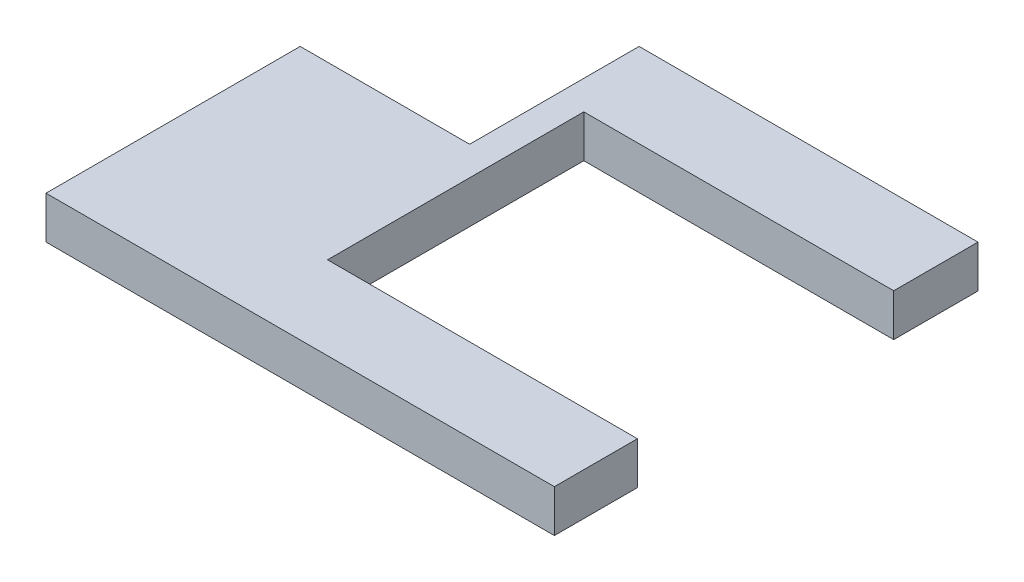
ISO-10303-21;
HEADER;
FILE_DESCRIPTION(('STEP AP214'),'2;1');
FILE_NAME('part.step','',(''),(''),'','','');
FILE_SCHEMA(('AUTOMOTIVE_DESIGN { 1 0 10303 214 1 1 1 1 }'));
ENDSEC;
DATA;
#1=APPLICATION_CONTEXT('core data for automotive mechanical design processes');
#2=APPLICATION_PROTOCOL_DEFINITION('international standard','automotive_design',2000,#1);
#3=PRODUCT_CONTEXT('',#1,'mechanical');
#4=PRODUCT('Part','Part','',(#3));
#5=PRODUCT_RELATED_PRODUCT_CATEGORY('part','',(#4));
#6=PRODUCT_DEFINITION_FORMATION('','',#4);
#7=PRODUCT_DEFINITION_CONTEXT('part definition',#1,'design');
#8=PRODUCT_DEFINITION('design','',#6,#7);
#9=PRODUCT_DEFINITION_SHAPE('','',#8);
#10=(LENGTH_UNIT() NAMED_UNIT(*) SI_UNIT(.MILLI.,.METRE.));
#11=(NAMED_UNIT(*) PLANE_ANGLE_UNIT() SI_UNIT($,.RADIAN.));
#12=(NAMED_UNIT(*) SI_UNIT($,.STERADIAN.) SOLID_ANGLE_UNIT());
#13=UNCERTAINTY_MEASURE_WITH_UNIT(LENGTH_MEASURE(1.E-05),#10,'distance_accuracy_value','');
#14=(GEOMETRIC_REPRESENTATION_CONTEXT(3) GLOBAL_UNCERTAINTY_ASSIGNED_CONTEXT((#13)) GLOBAL_UNIT_ASSIGNED_CONTEXT((#10,
#11,#12)) REPRESENTATION_CONTEXT('',''));
#15=CARTESIAN_POINT('',(0.,0.,0.));
#16=DIRECTION('',(0.,0.,1.));
#17=DIRECTION('',(1.,0.,0.));
#18=AXIS2_PLACEMENT_3D('',#15,#16,#17);
#19=CARTESIAN_POINT('',(0.,10.,-60.));
#20=DIRECTION('',(1.,0.,0.));
#21=DIRECTION('',(0.,0.,-1.));
#22=AXIS2_PLACEMENT_3D('',#19,#20,#21);
#23=PLANE('',#22);
#24=DIRECTION('',(0.,0.,1.));
#25=VECTOR('',#24,1.);
#26=CARTESIAN_POINT('',(0.,0.,-60.));
#27=LINE('',#26,#25);
#28=CARTESIAN_POINT('',(0.,0.,-60.));
#29=VERTEX_POINT('',#28);
#30=CARTESIAN_POINT('',(0.,0.,0.));
#31=VERTEX_POINT('',#30);
#32=EDGE_CURVE('E143',#29,#31,#27,.T.);
#33=ORIENTED_EDGE('',*,*,#32,.T.);
#34=DIRECTION('',(0.,-1.,0.));
#35=VECTOR('',#34,1.);
#36=CARTESIAN_POINT('',(0.,10.,0.));
#37=LINE('',#36,#35);
#38=CARTESIAN_POINT('',(0.,10.,0.));
#39=VERTEX_POINT('',#38);
#40=EDGE_CURVE('E11',#39,#31,#37,.T.);
#41=ORIENTED_EDGE('',*,*,#40,.F.);
#42=DIRECTION('',(0.,0.,1.));
#43=VECTOR('',#42,1.);
#44=CARTESIAN_POINT('',(0.,10.,-60.));
#45=LINE('',#44,#43);
#46=CARTESIAN_POINT('',(0.,10.,-60.));
#47=VERTEX_POINT('',#46);
#48=EDGE_CURVE('E161',#47,#39,#45,.T.);
#49=ORIENTED_EDGE('',*,*,#48,.F.);
#50=DIRECTION('',(0.,-1.,0.));
#51=VECTOR('',#50,1.);
#52=CARTESIAN_POINT('',(0.,10.,-60.));
#53=LINE('',#52,#51);
#54=EDGE_CURVE('E139',#47,#29,#53,.T.);
#55=ORIENTED_EDGE('',*,*,#54,.T.);
#56=EDGE_LOOP('',(#33,#41,#49,#55));
#57=FACE_BOUND('',#56,.T.);
#58=ADVANCED_FACE('F35',(#57),#23,.F.);
#59=CARTESIAN_POINT('',(0.,10.,0.));
#60=DIRECTION('',(0.,0.,-1.));
#61=DIRECTION('',(-1.,0.,0.));
#62=AXIS2_PLACEMENT_3D('',#59,#60,#61);
#63=PLANE('',#62);
#64=DIRECTION('',(1.,0.,0.));
#65=VECTOR('',#64,1.);
#66=CARTESIAN_POINT('',(0.,0.,0.));
#67=LINE('',#66,#65);
#68=CARTESIAN_POINT('',(120.,0.,0.));
#69=VERTEX_POINT('',#68);
#70=EDGE_CURVE('E146',#31,#69,#67,.T.);
#71=ORIENTED_EDGE('',*,*,#70,.T.);
#72=DIRECTION('',(0.,-1.,0.));
#73=VECTOR('',#72,1.);
#74=CARTESIAN_POINT('',(120.,10.,0.));
#75=LINE('',#74,#73);
#76=CARTESIAN_POINT('',(120.,10.,0.));
#77=VERTEX_POINT('',#76);
#78=EDGE_CURVE('E43',#77,#69,#75,.T.);
#79=ORIENTED_EDGE('',*,*,#78,.F.);
#80=DIRECTION('',(1.,0.,0.));
#81=VECTOR('',#80,1.);
#82=CARTESIAN_POINT('',(0.,10.,0.));
#83=LINE('',#82,#81);
#84=EDGE_CURVE('E100',#39,#77,#83,.T.);
#85=ORIENTED_EDGE('',*,*,#84,.F.);
#86=ORIENTED_EDGE('',*,*,#40,.T.);
#87=EDGE_LOOP('',(#71,#79,#85,#86));
#88=FACE_BOUND('',#87,.T.);
#89=ADVANCED_FACE('F210',(#88),#63,.F.);
#90=CARTESIAN_POINT('',(120.,10.,0.));
#91=DIRECTION('',(-1.,0.,0.));
#92=DIRECTION('',(0.,0.,1.));
#93=AXIS2_PLACEMENT_3D('',#90,#91,#92);
#94=PLANE('',#93);
#95=DIRECTION('',(0.,0.,-1.));
#96=VECTOR('',#95,1.);
#97=CARTESIAN_POINT('',(120.,0.,0.));
#98=LINE('',#97,#96);
#99=CARTESIAN_POINT('',(120.,0.,-19.6053445452307));
#100=VERTEX_POINT('',#99);
#101=EDGE_CURVE('E148',#69,#100,#98,.T.);
#102=ORIENTED_EDGE('',*,*,#101,.T.);
#103=DIRECTION('',(0.,-1.,0.));
#104=VECTOR('',#103,1.);
#105=CARTESIAN_POINT('',(120.,10.,-19.6053445452307));
#106=LINE('',#105,#104);
#107=CARTESIAN_POINT('',(120.,10.,-19.6053445452307));
#108=VERTEX_POINT('',#107);
#109=EDGE_CURVE('E174',#108,#100,#106,.T.);
#110=ORIENTED_EDGE('',*,*,#109,.F.);
#111=DIRECTION('',(0.,0.,-1.));
#112=VECTOR('',#111,1.);
#113=CARTESIAN_POINT('',(120.,10.,0.));
#114=LINE('',#113,#112);
#115=EDGE_CURVE('E182',#77,#108,#114,.T.);
#116=ORIENTED_EDGE('',*,*,#115,.F.);
#117=ORIENTED_EDGE('',*,*,#78,.T.);
#118=EDGE_LOOP('',(#102,#110,#116,#117));
#119=FACE_BOUND('',#118,.T.);
#120=ADVANCED_FACE('F180',(#119),#94,.F.);
#121=CARTESIAN_POINT('',(120.,10.,-19.6053445452307));
#122=DIRECTION('',(0.,0.,1.));
#123=DIRECTION('',(1.,0.,0.));
#124=AXIS2_PLACEMENT_3D('',#121,#122,#123);
#125=PLANE('',#124);
#126=DIRECTION('',(-1.,0.,0.));
#127=VECTOR('',#126,1.);
#128=CARTESIAN_POINT('',(120.,0.,-19.6053445452307));
#129=LINE('',#128,#127);
#130=CARTESIAN_POINT('',(46.8508304600234,0.,-19.6053445452307));
#131=VERTEX_POINT('',#130);
#132=EDGE_CURVE('E150',#100,#131,#129,.T.);
#133=ORIENTED_EDGE('',*,*,#132,.T.);
#134=DIRECTION('',(0.,-1.,0.));
#135=VECTOR('',#134,1.);
#136=CARTESIAN_POINT('',(46.8508304600234,10.,-19.6053445452307));
#137=LINE('',#136,#135);
#138=CARTESIAN_POINT('',(46.8508304600234,10.,-19.6053445452307));
#139=VERTEX_POINT('',#138);
#140=EDGE_CURVE('E171',#139,#131,#137,.T.);
#141=ORIENTED_EDGE('',*,*,#140,.F.);
#142=DIRECTION('',(-1.,0.,0.));
#143=VECTOR('',#142,1.);
#144=CARTESIAN_POINT('',(120.,10.,-19.6053445452307));
#145=LINE('',#144,#143);
#146=EDGE_CURVE('E200',#108,#139,#145,.T.);
#147=ORIENTED_EDGE('',*,*,#146,.F.);
#148=ORIENTED_EDGE('',*,*,#109,.T.);
#149=EDGE_LOOP('',(#133,#141,#147,#148));
#150=FACE_BOUND('',#149,.T.);
#151=ADVANCED_FACE('F191',(#150),#125,.F.);
#152=CARTESIAN_POINT('',(46.8508304600234,10.,-19.6053445452307));
#153=DIRECTION('',(-1.,0.,0.));
#154=DIRECTION('',(0.,0.,1.));
#155=AXIS2_PLACEMENT_3D('',#152,#153,#154);
#156=PLANE('',#155);
#157=DIRECTION('',(0.,0.,-1.));
#158=VECTOR('',#157,1.);
#159=CARTESIAN_POINT('',(46.8508304600234,0.,-19.6053445452307));
#160=LINE('',#159,#158);
#161=CARTESIAN_POINT('',(46.8508304600234,0.,-80.1035520463399));
#162=VERTEX_POINT('',#161);
#163=EDGE_CURVE('E152',#131,#162,#160,.T.);
#164=ORIENTED_EDGE('',*,*,#163,.T.);
#165=DIRECTION('',(0.,-1.,0.));
#166=VECTOR('',#165,1.);
#167=CARTESIAN_POINT('',(46.8508304600234,10.,-80.1035520463399));
#168=LINE('',#167,#166);
#169=CARTESIAN_POINT('',(46.8508304600234,10.,-80.1035520463399));
#170=VERTEX_POINT('',#169);
#171=EDGE_CURVE('E168',#170,#162,#168,.T.);
#172=ORIENTED_EDGE('',*,*,#171,.F.);
#173=DIRECTION('',(0.,0.,-1.));
#174=VECTOR('',#173,1.);
#175=CARTESIAN_POINT('',(46.8508304600234,10.,-19.6053445452307));
#176=LINE('',#175,#174);
#177=EDGE_CURVE('E197',#139,#170,#176,.T.);
#178=ORIENTED_EDGE('',*,*,#177,.F.);
#179=ORIENTED_EDGE('',*,*,#140,.T.);
#180=EDGE_LOOP('',(#164,#172,#178,#179));
#181=FACE_BOUND('',#180,.T.);
#182=ADVANCED_FACE('F195',(#181),#156,.F.);
#183=CARTESIAN_POINT('',(46.8508304600234,10.,-80.1035520463399));
#184=DIRECTION('',(0.,0.,-1.));
#185=DIRECTION('',(-1.,0.,0.));
#186=AXIS2_PLACEMENT_3D('',#183,#184,#185);
#187=PLANE('',#186);
#188=DIRECTION('',(1.,0.,0.));
#189=VECTOR('',#188,1.);
#190=CARTESIAN_POINT('',(46.8508304600234,0.,-80.1035520463399));
#191=LINE('',#190,#189);
#192=CARTESIAN_POINT('',(120.,0.,-80.1035520463399));
#193=VERTEX_POINT('',#192);
#194=EDGE_CURVE('E154',#162,#193,#191,.T.);
#195=ORIENTED_EDGE('',*,*,#194,.T.);
#196=DIRECTION('',(0.,-1.,0.));
#197=VECTOR('',#196,1.);
#198=CARTESIAN_POINT('',(120.,10.,-80.1035520463399));
#199=LINE('',#198,#197);
#200=CARTESIAN_POINT('',(120.,10.,-80.1035520463399));
#201=VERTEX_POINT('',#200);
#202=EDGE_CURVE('E165',#201,#193,#199,.T.);
#203=ORIENTED_EDGE('',*,*,#202,.F.);
#204=DIRECTION('',(1.,0.,0.));
#205=VECTOR('',#204,1.);
#206=CARTESIAN_POINT('',(46.8508304600234,10.,-80.1035520463399));
#207=LINE('',#206,#205);
#208=EDGE_CURVE('E199',#170,#201,#207,.T.);
#209=ORIENTED_EDGE('',*,*,#208,.F.);
#210=ORIENTED_EDGE('',*,*,#171,.T.);
#211=EDGE_LOOP('',(#195,#203,#209,#210));
#212=FACE_BOUND('',#211,.T.);
#213=ADVANCED_FACE('F222',(#212),#187,.F.);
#214=CARTESIAN_POINT('',(120.,10.,-80.1035520463399));
#215=DIRECTION('',(-1.,0.,0.));
#216=DIRECTION('',(0.,0.,1.));
#217=AXIS2_PLACEMENT_3D('',#214,#215,#216);
#218=PLANE('',#217);
#219=DIRECTION('',(0.,0.,-1.));
#220=VECTOR('',#219,1.);
#221=CARTESIAN_POINT('',(120.,0.,-80.1035520463399));
#222=LINE('',#221,#220);
#223=CARTESIAN_POINT('',(120.,0.,-100.));
#224=VERTEX_POINT('',#223);
#225=EDGE_CURVE('E156',#193,#224,#222,.T.);
#226=ORIENTED_EDGE('',*,*,#225,.T.);
#227=DIRECTION('',(0.,-1.,0.));
#228=VECTOR('',#227,1.);
#229=CARTESIAN_POINT('',(120.,10.,-100.));
#230=LINE('',#229,#228);
#231=CARTESIAN_POINT('',(120.,10.,-100.));
#232=VERTEX_POINT('',#231);
#233=EDGE_CURVE('E134',#232,#224,#230,.T.);
#234=ORIENTED_EDGE('',*,*,#233,.F.);
#235=DIRECTION('',(0.,0.,-1.));
#236=VECTOR('',#235,1.);
#237=CARTESIAN_POINT('',(120.,10.,-80.1035520463399));
#238=LINE('',#237,#236);
#239=EDGE_CURVE('E125',#201,#232,#238,.T.);
#240=ORIENTED_EDGE('',*,*,#239,.F.);
#241=ORIENTED_EDGE('',*,*,#202,.T.);
#242=EDGE_LOOP('',(#226,#234,#240,#241));
#243=FACE_BOUND('',#242,.T.);
#244=ADVANCED_FACE('F225',(#243),#218,.F.);
#245=CARTESIAN_POINT('',(120.,10.,-100.));
#246=DIRECTION('',(0.,0.,1.));
#247=DIRECTION('',(1.,0.,0.));
#248=AXIS2_PLACEMENT_3D('',#245,#246,#247);
#249=PLANE('',#248);
#250=DIRECTION('',(-1.,0.,0.));
#251=VECTOR('',#250,1.);
#252=CARTESIAN_POINT('',(120.,0.,-100.));
#253=LINE('',#252,#251);
#254=CARTESIAN_POINT('',(40.,0.,-100.));
#255=VERTEX_POINT('',#254);
#256=EDGE_CURVE('E133',#224,#255,#253,.T.);
#257=ORIENTED_EDGE('',*,*,#256,.T.);
#258=DIRECTION('',(0.,-1.,0.));
#259=VECTOR('',#258,1.);
#260=CARTESIAN_POINT('',(40.,10.,-100.));
#261=LINE('',#260,#259);
#262=CARTESIAN_POINT('',(40.,10.,-100.));
#263=VERTEX_POINT('',#262);
#264=EDGE_CURVE('E130',#263,#255,#261,.T.);
#265=ORIENTED_EDGE('',*,*,#264,.F.);
#266=DIRECTION('',(-1.,0.,0.));
#267=VECTOR('',#266,1.);
#268=CARTESIAN_POINT('',(120.,10.,-100.));
#269=LINE('',#268,#267);
#270=EDGE_CURVE('E119',#232,#263,#269,.T.);
#271=ORIENTED_EDGE('',*,*,#270,.F.);
#272=ORIENTED_EDGE('',*,*,#233,.T.);
#273=EDGE_LOOP('',(#257,#265,#271,#272));
#274=FACE_BOUND('',#273,.T.);
#275=ADVANCED_FACE('F131',(#274),#249,.F.);
#276=CARTESIAN_POINT('',(40.,10.,-100.));
#277=DIRECTION('',(1.,0.,0.));
#278=DIRECTION('',(0.,0.,-1.));
#279=AXIS2_PLACEMENT_3D('',#276,#277,#278);
#280=PLANE('',#279);
#281=DIRECTION('',(0.,0.,1.));
#282=VECTOR('',#281,1.);
#283=CARTESIAN_POINT('',(40.,0.,-100.));
#284=LINE('',#283,#282);
#285=CARTESIAN_POINT('',(40.,0.,-60.));
#286=VERTEX_POINT('',#285);
#287=EDGE_CURVE('E86',#255,#286,#284,.T.);
#288=ORIENTED_EDGE('',*,*,#287,.T.);
#289=DIRECTION('',(0.,-1.,0.));
#290=VECTOR('',#289,1.);
#291=CARTESIAN_POINT('',(40.,10.,-60.));
#292=LINE('',#291,#290);
#293=CARTESIAN_POINT('',(40.,10.,-60.));
#294=VERTEX_POINT('',#293);
#295=EDGE_CURVE('E135',#294,#286,#292,.T.);
#296=ORIENTED_EDGE('',*,*,#295,.F.);
#297=DIRECTION('',(0.,0.,1.));
#298=VECTOR('',#297,1.);
#299=CARTESIAN_POINT('',(40.,10.,-100.));
#300=LINE('',#299,#298);
#301=EDGE_CURVE('E123',#263,#294,#300,.T.);
#302=ORIENTED_EDGE('',*,*,#301,.F.);
#303=ORIENTED_EDGE('',*,*,#264,.T.);
#304=EDGE_LOOP('',(#288,#296,#302,#303));
#305=FACE_BOUND('',#304,.T.);
#306=ADVANCED_FACE('F137',(#305),#280,.F.);
#307=CARTESIAN_POINT('',(40.,10.,-60.));
#308=DIRECTION('',(0.,0.,1.));
#309=DIRECTION('',(1.,0.,0.));
#310=AXIS2_PLACEMENT_3D('',#307,#308,#309);
#311=PLANE('',#310);
#312=DIRECTION('',(-1.,0.,0.));
#313=VECTOR('',#312,1.);
#314=CARTESIAN_POINT('',(40.,0.,-60.));
#315=LINE('',#314,#313);
#316=EDGE_CURVE('E92',#286,#29,#315,.T.);
#317=ORIENTED_EDGE('',*,*,#316,.T.);
#318=ORIENTED_EDGE('',*,*,#54,.F.);
#319=DIRECTION('',(-1.,0.,0.));
#320=VECTOR('',#319,1.);
#321=CARTESIAN_POINT('',(40.,10.,-60.));
#322=LINE('',#321,#320);
#323=EDGE_CURVE('E51',#294,#47,#322,.T.);
#324=ORIENTED_EDGE('',*,*,#323,.F.);
#325=ORIENTED_EDGE('',*,*,#295,.T.);
#326=EDGE_LOOP('',(#317,#318,#324,#325));
#327=FACE_BOUND('',#326,.T.);
#328=ADVANCED_FACE('F234',(#327),#311,.F.);
#329=CARTESIAN_POINT('',(0.,10.,0.));
#330=DIRECTION('',(0.,1.,0.));
#331=DIRECTION('',(0.,0.,1.));
#332=AXIS2_PLACEMENT_3D('',#329,#330,#331);
#333=PLANE('',#332);
#334=ORIENTED_EDGE('',*,*,#48,.T.);
#335=ORIENTED_EDGE('',*,*,#84,.T.);
#336=ORIENTED_EDGE('',*,*,#115,.T.);
#337=ORIENTED_EDGE('',*,*,#146,.T.);
#338=ORIENTED_EDGE('',*,*,#177,.T.);
#339=ORIENTED_EDGE('',*,*,#208,.T.);
#340=ORIENTED_EDGE('',*,*,#239,.T.);
#341=ORIENTED_EDGE('',*,*,#270,.T.);
#342=ORIENTED_EDGE('',*,*,#301,.T.);
#343=ORIENTED_EDGE('',*,*,#323,.T.);
#344=EDGE_LOOP('',(#334,#335,#336,#337,#338,#339,#340,#341,#342,#343));
#345=FACE_BOUND('',#344,.T.);
#346=ADVANCED_FACE('F121',(#345),#333,.T.);
#347=CARTESIAN_POINT('',(0.,0.,0.));
#348=DIRECTION('',(0.,1.,0.));
#349=DIRECTION('',(0.,0.,1.));
#350=AXIS2_PLACEMENT_3D('',#347,#348,#349);
#351=PLANE('',#350);
#352=ORIENTED_EDGE('',*,*,#32,.F.);
#353=ORIENTED_EDGE('',*,*,#316,.F.);
#354=ORIENTED_EDGE('',*,*,#287,.F.);
#355=ORIENTED_EDGE('',*,*,#256,.F.);
#356=ORIENTED_EDGE('',*,*,#225,.F.);
#357=ORIENTED_EDGE('',*,*,#194,.F.);
#358=ORIENTED_EDGE('',*,*,#163,.F.);
#359=ORIENTED_EDGE('',*,*,#132,.F.);
#360=ORIENTED_EDGE('',*,*,#101,.F.);
#361=ORIENTED_EDGE('',*,*,#70,.F.);
#362=EDGE_LOOP('',(#352,#353,#354,#355,#356,#357,#358,#359,#360,#361));
#363=FACE_BOUND('',#362,.T.);
#364=ADVANCED_FACE('F186',(#363),#351,.F.);
#365=CLOSED_SHELL('',(#58,#89,#120,#151,#182,#213,#244,#275,#306,#328,#346,#364));
#366=MANIFOLD_SOLID_BREP('B2',#365);
#367=ADVANCED_BREP_SHAPE_REPRESENTATION('',(#18,#366),#14);
#368=SHAPE_DEFINITION_REPRESENTATION(#9,#367);
ENDSEC;
END-ISO-10303-21;
